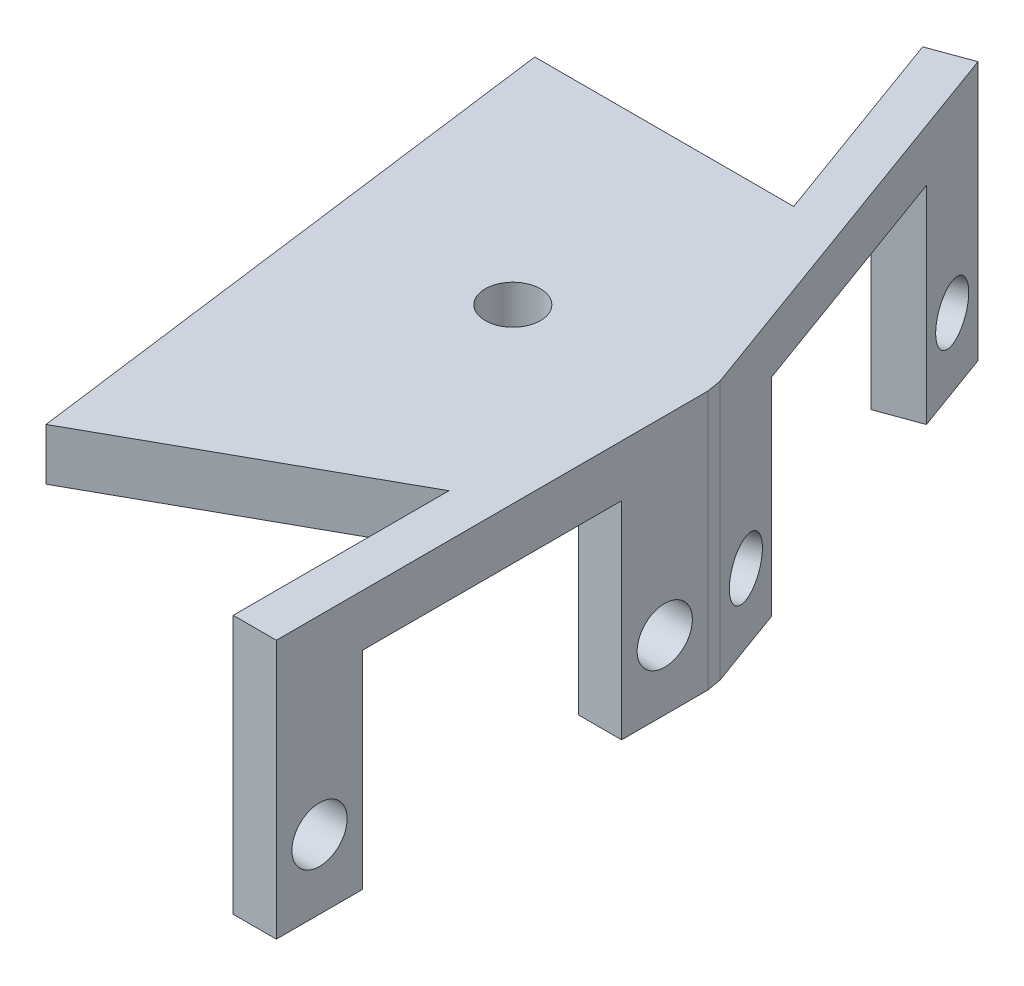
ISO-10303-21;
HEADER;
FILE_DESCRIPTION(('STEP AP214'),'2;1');
FILE_NAME('part.step','',(''),(''),'','','');
FILE_SCHEMA(('AUTOMOTIVE_DESIGN { 1 0 10303 214 1 1 1 1 }'));
ENDSEC;
DATA;
#1=APPLICATION_CONTEXT('core data for automotive mechanical design processes');
#2=APPLICATION_PROTOCOL_DEFINITION('international standard','automotive_design',2000,#1);
#3=PRODUCT_CONTEXT('',#1,'mechanical');
#4=PRODUCT('Part','Part','',(#3));
#5=PRODUCT_RELATED_PRODUCT_CATEGORY('part','',(#4));
#6=PRODUCT_DEFINITION_FORMATION('','',#4);
#7=PRODUCT_DEFINITION_CONTEXT('part definition',#1,'design');
#8=PRODUCT_DEFINITION('design','',#6,#7);
#9=PRODUCT_DEFINITION_SHAPE('','',#8);
#10=(LENGTH_UNIT() NAMED_UNIT(*) SI_UNIT(.MILLI.,.METRE.));
#11=(NAMED_UNIT(*) PLANE_ANGLE_UNIT() SI_UNIT($,.RADIAN.));
#12=(NAMED_UNIT(*) SI_UNIT($,.STERADIAN.) SOLID_ANGLE_UNIT());
#13=UNCERTAINTY_MEASURE_WITH_UNIT(LENGTH_MEASURE(1.E-05),#10,'distance_accuracy_value','');
#14=(GEOMETRIC_REPRESENTATION_CONTEXT(3) GLOBAL_UNCERTAINTY_ASSIGNED_CONTEXT((#13)) GLOBAL_UNIT_ASSIGNED_CONTEXT((#10,
#11,#12)) REPRESENTATION_CONTEXT('',''));
#15=CARTESIAN_POINT('',(0.,0.,0.));
#16=DIRECTION('',(0.,0.,1.));
#17=DIRECTION('',(1.,0.,0.));
#18=AXIS2_PLACEMENT_3D('',#15,#16,#17);
#19=CARTESIAN_POINT('',(-2.96984631039288,-15.,0.));
#20=DIRECTION('',(-1.,0.,0.));
#21=DIRECTION('',(0.,0.,1.));
#22=AXIS2_PLACEMENT_3D('',#19,#20,#21);
#23=PLANE('',#22);
#24=DIRECTION('',(0.,1.,0.));
#25=VECTOR('',#24,1.);
#26=CARTESIAN_POINT('',(-2.96984631039287,-3.,12.6710100716628));
#27=LINE('',#26,#25);
#28=CARTESIAN_POINT('',(-2.96984631039279,-3.,12.6710100716623));
#29=VERTEX_POINT('',#28);
#30=CARTESIAN_POINT('',(-2.96984631039281,0.,12.6710100716628));
#31=VERTEX_POINT('',#30);
#32=EDGE_CURVE('E214',#29,#31,#27,.T.);
#33=ORIENTED_EDGE('',*,*,#32,.F.);
#34=DIRECTION('',(0.,0.,-1.));
#35=VECTOR('',#34,1.);
#36=CARTESIAN_POINT('',(-2.96984631039288,-3.,0.));
#37=LINE('',#36,#35);
#38=CARTESIAN_POINT('',(-2.9698463103928,-3.,20.1710100716628));
#39=VERTEX_POINT('',#38);
#40=EDGE_CURVE('E341',#39,#29,#37,.T.);
#41=ORIENTED_EDGE('',*,*,#40,.F.);
#42=DIRECTION('',(0.,1.,0.));
#43=VECTOR('',#42,1.);
#44=CARTESIAN_POINT('',(-2.96984631039276,-15.,20.1710100716628));
#45=LINE('',#44,#43);
#46=CARTESIAN_POINT('',(-2.96984631039281,-15.,20.1710100716628));
#47=VERTEX_POINT('',#46);
#48=EDGE_CURVE('E273',#47,#39,#45,.T.);
#49=ORIENTED_EDGE('',*,*,#48,.F.);
#50=DIRECTION('',(0.,0.,1.));
#51=VECTOR('',#50,1.);
#52=CARTESIAN_POINT('',(-2.96984631039288,-15.,0.));
#53=LINE('',#52,#51);
#54=CARTESIAN_POINT('',(-2.96984631039274,-15.,25.1710100716628));
#55=VERTEX_POINT('',#54);
#56=EDGE_CURVE('E291',#47,#55,#53,.T.);
#57=ORIENTED_EDGE('',*,*,#56,.T.);
#58=DIRECTION('',(0.,1.,0.));
#59=VECTOR('',#58,1.);
#60=CARTESIAN_POINT('',(-2.96984631039274,-15.,25.1710100716628));
#61=LINE('',#60,#59);
#62=CARTESIAN_POINT('',(-2.96984631039274,0.,25.1710100716628));
#63=VERTEX_POINT('',#62);
#64=EDGE_CURVE('E326',#55,#63,#61,.T.);
#65=ORIENTED_EDGE('',*,*,#64,.T.);
#66=DIRECTION('',(0.,0.,1.));
#67=VECTOR('',#66,1.);
#68=CARTESIAN_POINT('',(-2.96984631039288,0.,0.));
#69=LINE('',#68,#67);
#70=EDGE_CURVE('E66',#31,#63,#69,.T.);
#71=ORIENTED_EDGE('',*,*,#70,.F.);
#72=EDGE_LOOP('',(#33,#41,#49,#57,#65,#71));
#73=FACE_BOUND('',#72,.T.);
#74=CARTESIAN_POINT('',(-2.96984631039275,-11.,22.6710100716628));
#75=DIRECTION('',(-1.,0.,0.));
#76=DIRECTION('',(0.,0.,1.));
#77=AXIS2_PLACEMENT_3D('',#74,#75,#76);
#78=CIRCLE('',#77,1.6);
#79=CARTESIAN_POINT('',(-2.96984631039274,-11.,24.2710100716628));
#80=VERTEX_POINT('',#79);
#81=EDGE_CURVE('E275',#80,#80,#78,.T.);
#82=ORIENTED_EDGE('',*,*,#81,.F.);
#83=EDGE_LOOP('',(#82));
#84=FACE_BOUND('',#83,.T.);
#85=ADVANCED_FACE('F43',(#73,#84),#23,.T.);
#86=CARTESIAN_POINT('',(-2.67740186429161,-15.,0.974494583770972));
#87=DIRECTION('',(0.93969262078591,0.,-0.342020143325665));
#88=DIRECTION('',(-0.342020143325665,0.,-0.93969262078591));
#89=AXIS2_PLACEMENT_3D('',#86,#87,#88);
#90=PLANE('',#89);
#91=CARTESIAN_POINT('',(-10.6652995352203,-11.,-20.9720738960201));
#92=DIRECTION('',(0.93969262078591,0.,-0.342020143325665));
#93=DIRECTION('',(-0.342020143325665,0.,-0.93969262078591));
#94=AXIS2_PLACEMENT_3D('',#91,#92,#93);
#95=CIRCLE('',#94,1.6);
#96=CARTESIAN_POINT('',(-11.2125317645414,-11.,-22.4755820892776));
#97=VERTEX_POINT('',#96);
#98=EDGE_CURVE('E250',#97,#97,#95,.T.);
#99=ORIENTED_EDGE('',*,*,#98,.T.);
#100=EDGE_LOOP('',(#99));
#101=FACE_BOUND('',#100,.T.);
#102=DIRECTION('',(0.342020143325665,0.,0.93969262078591));
#103=VECTOR('',#102,1.);
#104=CARTESIAN_POINT('',(-2.67740186429161,-3.,0.974494583770971));
#105=LINE('',#104,#103);
#106=CARTESIAN_POINT('',(-9.81024917690618,-3.,-18.6228423440554));
#107=VERTEX_POINT('',#106);
#108=CARTESIAN_POINT('',(-7.24509810196369,-3.,-11.5751476881611));
#109=VERTEX_POINT('',#108);
#110=EDGE_CURVE('E245',#107,#109,#105,.T.);
#111=ORIENTED_EDGE('',*,*,#110,.T.);
#112=DIRECTION('',(0.,1.,0.));
#113=VECTOR('',#112,1.);
#114=CARTESIAN_POINT('',(-7.24509810196369,-3.,-11.5751476881611));
#115=LINE('',#114,#113);
#116=CARTESIAN_POINT('',(-7.24509810196369,0.,-11.5751476881611));
#117=VERTEX_POINT('',#116);
#118=EDGE_CURVE('E186',#109,#117,#115,.T.);
#119=ORIENTED_EDGE('',*,*,#118,.T.);
#120=DIRECTION('',(-0.342020143325665,0.,-0.93969262078591));
#121=VECTOR('',#120,1.);
#122=CARTESIAN_POINT('',(-2.67740186429161,0.,0.974494583770972));
#123=LINE('',#122,#121);
#124=CARTESIAN_POINT('',(-11.5203498935345,0.,-23.3213054479849));
#125=VERTEX_POINT('',#124);
#126=EDGE_CURVE('E313',#117,#125,#123,.T.);
#127=ORIENTED_EDGE('',*,*,#126,.T.);
#128=DIRECTION('',(0.,1.,0.));
#129=VECTOR('',#128,1.);
#130=CARTESIAN_POINT('',(-11.5203498935345,-15.,-23.3213054479849));
#131=LINE('',#130,#129);
#132=CARTESIAN_POINT('',(-11.5203498935345,-15.,-23.3213054479849));
#133=VERTEX_POINT('',#132);
#134=EDGE_CURVE('E330',#133,#125,#131,.T.);
#135=ORIENTED_EDGE('',*,*,#134,.F.);
#136=DIRECTION('',(-0.342020143325665,0.,-0.93969262078591));
#137=VECTOR('',#136,1.);
#138=CARTESIAN_POINT('',(-2.67740186429161,-15.,0.974494583770972));
#139=LINE('',#138,#137);
#140=CARTESIAN_POINT('',(-9.81024917690618,-15.,-18.6228423440554));
#141=VERTEX_POINT('',#140);
#142=EDGE_CURVE('E287',#141,#133,#139,.T.);
#143=ORIENTED_EDGE('',*,*,#142,.F.);
#144=DIRECTION('',(0.,1.,0.));
#145=VECTOR('',#144,1.);
#146=CARTESIAN_POINT('',(-9.81024917690618,-15.,-18.6228423440554));
#147=LINE('',#146,#145);
#148=EDGE_CURVE('E238',#141,#107,#147,.T.);
#149=ORIENTED_EDGE('',*,*,#148,.T.);
#150=EDGE_LOOP('',(#111,#119,#127,#135,#143,#149));
#151=FACE_BOUND('',#150,.T.);
#152=ADVANCED_FACE('F355',(#101,#151),#90,.F.);
#153=CARTESIAN_POINT('',(0.,-15.,0.));
#154=DIRECTION('',(0.,1.,0.));
#155=DIRECTION('',(0.,0.,1.));
#156=AXIS2_PLACEMENT_3D('',#153,#154,#155);
#157=PLANE('',#156);
#158=CARTESIAN_POINT('',(-2.96984631039287,-15.,0.171010071662813));
#159=VERTEX_POINT('',#158);
#160=CARTESIAN_POINT('',(-4.6799470270212,-15.,-4.52745303226673));
#161=VERTEX_POINT('',#160);
#162=EDGE_CURVE('E288',#159,#161,#139,.T.);
#163=ORIENTED_EDGE('',*,*,#162,.T.);
#164=DIRECTION('',(0.93969262078591,0.,-0.342020143325665));
#165=VECTOR('',#164,1.);
#166=CARTESIAN_POINT('',(-2.00254516272959,-15.,-5.50194761603771));
#167=LINE('',#166,#165);
#168=CARTESIAN_POINT('',(-2.33071547505643,-15.,-5.3825033905809));
#169=VERTEX_POINT('',#168);
#170=EDGE_CURVE('E11',#161,#169,#167,.T.);
#171=ORIENTED_EDGE('',*,*,#170,.T.);
#172=DIRECTION('',(-0.342020143325665,0.,-0.93969262078591));
#173=VECTOR('',#172,1.);
#174=CARTESIAN_POINT('',(-0.328170312326833,-15.,0.119444225456809));
#175=LINE('',#174,#173);
#176=CARTESIAN_POINT('',(-0.620614758428101,-15.,-0.684040286651349));
#177=VERTEX_POINT('',#176);
#178=EDGE_CURVE('E281',#177,#169,#175,.T.);
#179=ORIENTED_EDGE('',*,*,#178,.F.);
#180=DIRECTION('',(0.173648177667021,0.,0.984807753012192));
#181=VECTOR('',#180,1.);
#182=CARTESIAN_POINT('',(-0.484923155196316,-15.,0.0855050358314348));
#183=LINE('',#182,#181);
#184=CARTESIAN_POINT('',(-0.469846310392793,-15.,0.171010071662807));
#185=VERTEX_POINT('',#184);
#186=EDGE_CURVE('E276',#177,#185,#183,.T.);
#187=ORIENTED_EDGE('',*,*,#186,.T.);
#188=DIRECTION('',(0.,0.,1.));
#189=VECTOR('',#188,1.);
#190=CARTESIAN_POINT('',(-0.469846310392794,-15.,0.));
#191=LINE('',#190,#189);
#192=CARTESIAN_POINT('',(-0.469846310392794,-15.,5.17101007166281));
#193=VERTEX_POINT('',#192);
#194=EDGE_CURVE('E299',#185,#193,#191,.T.);
#195=ORIENTED_EDGE('',*,*,#194,.T.);
#196=DIRECTION('',(-1.,0.,0.));
#197=VECTOR('',#196,1.);
#198=CARTESIAN_POINT('',(0.,-15.,5.17101007166281));
#199=LINE('',#198,#197);
#200=CARTESIAN_POINT('',(-2.96984631039285,-15.,5.17101007166281));
#201=VERTEX_POINT('',#200);
#202=EDGE_CURVE('E322',#193,#201,#199,.T.);
#203=ORIENTED_EDGE('',*,*,#202,.T.);
#204=EDGE_CURVE('E292',#159,#201,#53,.T.);
#205=ORIENTED_EDGE('',*,*,#204,.F.);
#206=EDGE_LOOP('',(#163,#171,#179,#187,#195,#203,#205));
#207=FACE_BOUND('',#206,.T.);
#208=ADVANCED_FACE('F380',(#207),#157,.F.);
#209=ORIENTED_EDGE('',*,*,#56,.F.);
#210=DIRECTION('',(1.,0.,0.));
#211=VECTOR('',#210,1.);
#212=CARTESIAN_POINT('',(0.,-15.,20.1710100716628));
#213=LINE('',#212,#211);
#214=CARTESIAN_POINT('',(-0.469846310392794,-15.,20.1710100716628));
#215=VERTEX_POINT('',#214);
#216=EDGE_CURVE('E338',#47,#215,#213,.T.);
#217=ORIENTED_EDGE('',*,*,#216,.T.);
#218=CARTESIAN_POINT('',(-0.469846310392736,-15.,25.1710100716628));
#219=VERTEX_POINT('',#218);
#220=EDGE_CURVE('E298',#215,#219,#191,.T.);
#221=ORIENTED_EDGE('',*,*,#220,.T.);
#222=DIRECTION('',(-1.,0.,0.));
#223=VECTOR('',#222,1.);
#224=CARTESIAN_POINT('',(2.79454349346317E-13,-15.,25.1710100716628));
#225=LINE('',#224,#223);
#226=EDGE_CURVE('E295',#219,#55,#225,.T.);
#227=ORIENTED_EDGE('',*,*,#226,.T.);
#228=EDGE_LOOP('',(#209,#217,#221,#227));
#229=FACE_BOUND('',#228,.T.);
#230=ADVANCED_FACE('F404',(#229),#157,.F.);
#231=CARTESIAN_POINT('',(-0.484923155196316,-15.,0.0855050358314348));
#232=DIRECTION('',(-0.984807753012192,0.,0.173648177667021));
#233=DIRECTION('',(0.173648177667021,0.,0.984807753012192));
#234=AXIS2_PLACEMENT_3D('',#231,#232,#233);
#235=PLANE('',#234);
#236=DIRECTION('',(0.,1.,0.));
#237=VECTOR('',#236,1.);
#238=CARTESIAN_POINT('',(-0.620614758428101,-15.,-0.684040286651349));
#239=LINE('',#238,#237);
#240=CARTESIAN_POINT('',(-0.620614758428101,0.,-0.684040286651349));
#241=VERTEX_POINT('',#240);
#242=EDGE_CURVE('E302',#177,#241,#239,.T.);
#243=ORIENTED_EDGE('',*,*,#242,.T.);
#244=DIRECTION('',(0.173648177667021,0.,0.984807753012192));
#245=VECTOR('',#244,1.);
#246=CARTESIAN_POINT('',(-0.484923155196316,0.,0.0855050358314348));
#247=LINE('',#246,#245);
#248=CARTESIAN_POINT('',(-0.469846310392793,0.,0.171010071662807));
#249=VERTEX_POINT('',#248);
#250=EDGE_CURVE('E303',#241,#249,#247,.T.);
#251=ORIENTED_EDGE('',*,*,#250,.T.);
#252=DIRECTION('',(0.,1.,0.));
#253=VECTOR('',#252,1.);
#254=CARTESIAN_POINT('',(-0.469846310392793,-15.,0.171010071662807));
#255=LINE('',#254,#253);
#256=EDGE_CURVE('E320',#185,#249,#255,.T.);
#257=ORIENTED_EDGE('',*,*,#256,.F.);
#258=ORIENTED_EDGE('',*,*,#186,.F.);
#259=EDGE_LOOP('',(#243,#251,#257,#258));
#260=FACE_BOUND('',#259,.T.);
#261=ADVANCED_FACE('F45',(#260),#235,.F.);
#262=CARTESIAN_POINT('',(-0.469846310392794,-15.,0.));
#263=DIRECTION('',(-1.,0.,0.));
#264=DIRECTION('',(0.,0.,1.));
#265=AXIS2_PLACEMENT_3D('',#262,#263,#264);
#266=PLANE('',#265);
#267=CARTESIAN_POINT('',(-0.469846310392794,-11.,2.67101007166279));
#268=DIRECTION('',(1.,0.,0.));
#269=DIRECTION('',(0.,0.,-1.));
#270=AXIS2_PLACEMENT_3D('',#267,#268,#269);
#271=CIRCLE('',#270,1.6);
#272=CARTESIAN_POINT('',(-0.469846310392794,-11.,1.07101007166278));
#273=VERTEX_POINT('',#272);
#274=EDGE_CURVE('E253',#273,#273,#271,.T.);
#275=ORIENTED_EDGE('',*,*,#274,.F.);
#276=EDGE_LOOP('',(#275));
#277=FACE_BOUND('',#276,.T.);
#278=CARTESIAN_POINT('',(-0.469846310392794,-11.,22.6710100716628));
#279=DIRECTION('',(1.,0.,0.));
#280=DIRECTION('',(0.,0.,-1.));
#281=AXIS2_PLACEMENT_3D('',#278,#279,#280);
#282=CIRCLE('',#281,1.6);
#283=CARTESIAN_POINT('',(-0.469846310392794,-11.,21.0710100716628));
#284=VERTEX_POINT('',#283);
#285=EDGE_CURVE('E254',#284,#284,#282,.T.);
#286=ORIENTED_EDGE('',*,*,#285,.F.);
#287=EDGE_LOOP('',(#286));
#288=FACE_BOUND('',#287,.T.);
#289=ORIENTED_EDGE('',*,*,#220,.F.);
#290=DIRECTION('',(0.,-1.,0.));
#291=VECTOR('',#290,1.);
#292=CARTESIAN_POINT('',(-0.469846310392794,-15.,20.1710100716628));
#293=LINE('',#292,#291);
#294=CARTESIAN_POINT('',(-0.469846310392794,-3.,20.1710100716628));
#295=VERTEX_POINT('',#294);
#296=EDGE_CURVE('E257',#295,#215,#293,.T.);
#297=ORIENTED_EDGE('',*,*,#296,.F.);
#298=DIRECTION('',(0.,0.,1.));
#299=VECTOR('',#298,1.);
#300=CARTESIAN_POINT('',(-0.469846310392794,-3.,20.1710100716628));
#301=LINE('',#300,#299);
#302=CARTESIAN_POINT('',(-0.469846310392794,-3.,5.17101007166281));
#303=VERTEX_POINT('',#302);
#304=EDGE_CURVE('E264',#303,#295,#301,.T.);
#305=ORIENTED_EDGE('',*,*,#304,.F.);
#306=DIRECTION('',(0.,1.,0.));
#307=VECTOR('',#306,1.);
#308=CARTESIAN_POINT('',(-0.469846310392794,-15.,5.17101007166281));
#309=LINE('',#308,#307);
#310=EDGE_CURVE('E261',#193,#303,#309,.T.);
#311=ORIENTED_EDGE('',*,*,#310,.F.);
#312=ORIENTED_EDGE('',*,*,#194,.F.);
#313=ORIENTED_EDGE('',*,*,#256,.T.);
#314=DIRECTION('',(0.,0.,1.));
#315=VECTOR('',#314,1.);
#316=CARTESIAN_POINT('',(-0.469846310392794,0.,0.));
#317=LINE('',#316,#315);
#318=CARTESIAN_POINT('',(-0.469846310392736,0.,25.1710100716628));
#319=VERTEX_POINT('',#318);
#320=EDGE_CURVE('E280',#249,#319,#317,.T.);
#321=ORIENTED_EDGE('',*,*,#320,.T.);
#322=DIRECTION('',(0.,1.,0.));
#323=VECTOR('',#322,1.);
#324=CARTESIAN_POINT('',(-0.469846310392736,-15.,25.1710100716628));
#325=LINE('',#324,#323);
#326=EDGE_CURVE('E323',#219,#319,#325,.T.);
#327=ORIENTED_EDGE('',*,*,#326,.F.);
#328=EDGE_LOOP('',(#289,#297,#305,#311,#312,#313,#321,#327));
#329=FACE_BOUND('',#328,.T.);
#330=ADVANCED_FACE('F397',(#277,#288,#329),#266,.F.);
#331=CARTESIAN_POINT('',(2.79454349346317E-13,-15.,25.1710100716628));
#332=DIRECTION('',(0.,0.,-1.));
#333=DIRECTION('',(-1.,0.,0.));
#334=AXIS2_PLACEMENT_3D('',#331,#332,#333);
#335=PLANE('',#334);
#336=DIRECTION('',(-1.,0.,0.));
#337=VECTOR('',#336,1.);
#338=CARTESIAN_POINT('',(2.79454349346317E-13,0.,25.1710100716628));
#339=LINE('',#338,#337);
#340=EDGE_CURVE('E316',#319,#63,#339,.T.);
#341=ORIENTED_EDGE('',*,*,#340,.T.);
#342=ORIENTED_EDGE('',*,*,#64,.F.);
#343=ORIENTED_EDGE('',*,*,#226,.F.);
#344=ORIENTED_EDGE('',*,*,#326,.T.);
#345=EDGE_LOOP('',(#341,#342,#343,#344));
#346=FACE_BOUND('',#345,.T.);
#347=ADVANCED_FACE('F413',(#346),#335,.F.);
#348=DIRECTION('',(0.,0.,1.));
#349=VECTOR('',#348,1.);
#350=CARTESIAN_POINT('',(-2.96984631039288,-3.,0.));
#351=LINE('',#350,#349);
#352=CARTESIAN_POINT('',(-2.96984631039287,-3.,0.171010071662813));
#353=VERTEX_POINT('',#352);
#354=CARTESIAN_POINT('',(-2.96984631039285,-3.,5.17101007166281));
#355=VERTEX_POINT('',#354);
#356=EDGE_CURVE('E58',#353,#355,#351,.T.);
#357=ORIENTED_EDGE('',*,*,#356,.F.);
#358=DIRECTION('',(0.,1.,0.));
#359=VECTOR('',#358,1.);
#360=CARTESIAN_POINT('',(-2.96984631039287,-15.,0.171010071662813));
#361=LINE('',#360,#359);
#362=EDGE_CURVE('E328',#159,#353,#361,.T.);
#363=ORIENTED_EDGE('',*,*,#362,.F.);
#364=ORIENTED_EDGE('',*,*,#204,.T.);
#365=DIRECTION('',(0.,-1.,0.));
#366=VECTOR('',#365,1.);
#367=CARTESIAN_POINT('',(-2.96984631039285,-15.,5.17101007166281));
#368=LINE('',#367,#366);
#369=EDGE_CURVE('E270',#355,#201,#368,.T.);
#370=ORIENTED_EDGE('',*,*,#369,.F.);
#371=EDGE_LOOP('',(#357,#363,#364,#370));
#372=FACE_BOUND('',#371,.T.);
#373=CARTESIAN_POINT('',(-2.96984631039286,-11.,2.67101007166279));
#374=DIRECTION('',(-1.,0.,0.));
#375=DIRECTION('',(0.,0.,1.));
#376=AXIS2_PLACEMENT_3D('',#373,#374,#375);
#377=CIRCLE('',#376,1.6);
#378=CARTESIAN_POINT('',(-2.96984631039285,-11.,4.27101007166279));
#379=VERTEX_POINT('',#378);
#380=EDGE_CURVE('E307',#379,#379,#377,.T.);
#381=ORIENTED_EDGE('',*,*,#380,.F.);
#382=EDGE_LOOP('',(#381));
#383=FACE_BOUND('',#382,.T.);
#384=ADVANCED_FACE('F414',(#372,#383),#23,.T.);
#385=CARTESIAN_POINT('',(-3.82489666870704,-11.,-2.17822148030196));
#386=DIRECTION('',(0.93969262078591,0.,-0.342020143325665));
#387=DIRECTION('',(-0.342020143325665,0.,-0.93969262078591));
#388=AXIS2_PLACEMENT_3D('',#385,#386,#387);
#389=CIRCLE('',#388,1.6);
#390=CARTESIAN_POINT('',(-4.3721288980281,-11.,-3.68172967355942));
#391=VERTEX_POINT('',#390);
#392=EDGE_CURVE('E247',#391,#391,#389,.T.);
#393=ORIENTED_EDGE('',*,*,#392,.T.);
#394=EDGE_LOOP('',(#393));
#395=FACE_BOUND('',#394,.T.);
#396=ORIENTED_EDGE('',*,*,#362,.T.);
#397=DIRECTION('',(-0.342020143325665,0.,-0.93969262078591));
#398=VECTOR('',#397,1.);
#399=CARTESIAN_POINT('',(-2.67740186429161,-3.,0.974494583770972));
#400=LINE('',#399,#398);
#401=CARTESIAN_POINT('',(-4.6799470270212,-3.,-4.52745303226673));
#402=VERTEX_POINT('',#401);
#403=EDGE_CURVE('E216',#353,#402,#400,.T.);
#404=ORIENTED_EDGE('',*,*,#403,.T.);
#405=DIRECTION('',(0.,-1.,0.));
#406=VECTOR('',#405,1.);
#407=CARTESIAN_POINT('',(-4.6799470270212,-15.,-4.52745303226673));
#408=LINE('',#407,#406);
#409=EDGE_CURVE('E242',#402,#161,#408,.T.);
#410=ORIENTED_EDGE('',*,*,#409,.T.);
#411=ORIENTED_EDGE('',*,*,#162,.F.);
#412=EDGE_LOOP('',(#396,#404,#410,#411));
#413=FACE_BOUND('',#412,.T.);
#414=ADVANCED_FACE('F387',(#395,#413),#90,.F.);
#415=CARTESIAN_POINT('',(-8.84294802924289,-15.,-24.2958000317559));
#416=DIRECTION('',(0.342020143325665,0.,0.93969262078591));
#417=DIRECTION('',(0.93969262078591,0.,-0.342020143325665));
#418=AXIS2_PLACEMENT_3D('',#415,#416,#417);
#419=PLANE('',#418);
#420=DIRECTION('',(0.93969262078591,0.,-0.342020143325665));
#421=VECTOR('',#420,1.);
#422=CARTESIAN_POINT('',(-8.84294802924289,0.,-24.2958000317559));
#423=LINE('',#422,#421);
#424=CARTESIAN_POINT('',(-9.17111834156973,0.,-24.1763558062991));
#425=VERTEX_POINT('',#424);
#426=EDGE_CURVE('E310',#125,#425,#423,.T.);
#427=ORIENTED_EDGE('',*,*,#426,.T.);
#428=DIRECTION('',(0.,1.,0.));
#429=VECTOR('',#428,1.);
#430=CARTESIAN_POINT('',(-9.17111834156973,-15.,-24.1763558062991));
#431=LINE('',#430,#429);
#432=CARTESIAN_POINT('',(-9.17111834156973,-15.,-24.1763558062991));
#433=VERTEX_POINT('',#432);
#434=EDGE_CURVE('E333',#433,#425,#431,.T.);
#435=ORIENTED_EDGE('',*,*,#434,.F.);
#436=DIRECTION('',(0.93969262078591,0.,-0.342020143325665));
#437=VECTOR('',#436,1.);
#438=CARTESIAN_POINT('',(-8.84294802924289,-15.,-24.2958000317559));
#439=LINE('',#438,#437);
#440=EDGE_CURVE('E284',#133,#433,#439,.T.);
#441=ORIENTED_EDGE('',*,*,#440,.F.);
#442=ORIENTED_EDGE('',*,*,#134,.T.);
#443=EDGE_LOOP('',(#427,#435,#441,#442));
#444=FACE_BOUND('',#443,.T.);
#445=ADVANCED_FACE('F360',(#444),#419,.F.);
#446=CARTESIAN_POINT('',(-0.328170312326833,-15.,0.119444225456809));
#447=DIRECTION('',(0.93969262078591,0.,-0.342020143325665));
#448=DIRECTION('',(-0.342020143325665,0.,-0.93969262078591));
#449=AXIS2_PLACEMENT_3D('',#446,#447,#448);
#450=PLANE('',#449);
#451=CARTESIAN_POINT('',(-8.31606798325557,-11.,-21.8271242543343));
#452=DIRECTION('',(0.93969262078591,0.,-0.342020143325665));
#453=DIRECTION('',(-0.342020143325665,0.,-0.93969262078591));
#454=AXIS2_PLACEMENT_3D('',#451,#452,#453);
#455=CIRCLE('',#454,1.6);
#456=CARTESIAN_POINT('',(-8.86330021257663,-11.,-23.3306324475918));
#457=VERTEX_POINT('',#456);
#458=EDGE_CURVE('E221',#457,#457,#455,.T.);
#459=ORIENTED_EDGE('',*,*,#458,.F.);
#460=EDGE_LOOP('',(#459));
#461=FACE_BOUND('',#460,.T.);
#462=CARTESIAN_POINT('',(-1.47566511674226,-11.,-3.03327183861612));
#463=DIRECTION('',(0.93969262078591,0.,-0.342020143325665));
#464=DIRECTION('',(-0.342020143325665,0.,-0.93969262078591));
#465=AXIS2_PLACEMENT_3D('',#462,#463,#464);
#466=CIRCLE('',#465,1.6);
#467=CARTESIAN_POINT('',(-2.02289734606333,-11.,-4.53678003187358));
#468=VERTEX_POINT('',#467);
#469=EDGE_CURVE('E222',#468,#468,#466,.T.);
#470=ORIENTED_EDGE('',*,*,#469,.F.);
#471=EDGE_LOOP('',(#470));
#472=FACE_BOUND('',#471,.T.);
#473=DIRECTION('',(0.,-1.,0.));
#474=VECTOR('',#473,1.);
#475=CARTESIAN_POINT('',(-2.33071547505643,-15.1192251931733,-5.3825033905809));
#476=LINE('',#475,#474);
#477=CARTESIAN_POINT('',(-2.33071547505643,-3.,-5.3825033905809));
#478=VERTEX_POINT('',#477);
#479=EDGE_CURVE('E225',#478,#169,#476,.T.);
#480=ORIENTED_EDGE('',*,*,#479,.F.);
#481=DIRECTION('',(0.342020143325665,0.,0.93969262078591));
#482=VECTOR('',#481,1.);
#483=CARTESIAN_POINT('',(-2.33071547505643,-3.,-5.3825033905809));
#484=LINE('',#483,#482);
#485=CARTESIAN_POINT('',(-7.46101762494141,-3.,-19.4778927023695));
#486=VERTEX_POINT('',#485);
#487=EDGE_CURVE('E232',#486,#478,#484,.T.);
#488=ORIENTED_EDGE('',*,*,#487,.F.);
#489=DIRECTION('',(0.,1.,0.));
#490=VECTOR('',#489,1.);
#491=CARTESIAN_POINT('',(-7.46101762494141,-15.1192251931733,-19.4778927023695));
#492=LINE('',#491,#490);
#493=CARTESIAN_POINT('',(-7.46101762494141,-15.,-19.4778927023695));
#494=VERTEX_POINT('',#493);
#495=EDGE_CURVE('E229',#494,#486,#492,.T.);
#496=ORIENTED_EDGE('',*,*,#495,.F.);
#497=EDGE_CURVE('E279',#494,#433,#175,.T.);
#498=ORIENTED_EDGE('',*,*,#497,.T.);
#499=ORIENTED_EDGE('',*,*,#434,.T.);
#500=DIRECTION('',(-0.342020143325665,0.,-0.93969262078591));
#501=VECTOR('',#500,1.);
#502=CARTESIAN_POINT('',(-0.328170312326833,0.,0.119444225456809));
#503=LINE('',#502,#501);
#504=EDGE_CURVE('E306',#241,#425,#503,.T.);
#505=ORIENTED_EDGE('',*,*,#504,.F.);
#506=ORIENTED_EDGE('',*,*,#242,.F.);
#507=ORIENTED_EDGE('',*,*,#178,.T.);
#508=EDGE_LOOP('',(#480,#488,#496,#498,#499,#505,#506,#507));
#509=FACE_BOUND('',#508,.T.);
#510=ADVANCED_FACE('F364',(#461,#472,#509),#450,.T.);
#511=ORIENTED_EDGE('',*,*,#497,.F.);
#512=DIRECTION('',(-0.93969262078591,0.,0.342020143325665));
#513=VECTOR('',#512,1.);
#514=CARTESIAN_POINT('',(-7.13284731261457,-15.,-19.5973369278263));
#515=LINE('',#514,#513);
#516=EDGE_CURVE('E51',#494,#141,#515,.T.);
#517=ORIENTED_EDGE('',*,*,#516,.T.);
#518=ORIENTED_EDGE('',*,*,#142,.T.);
#519=ORIENTED_EDGE('',*,*,#440,.T.);
#520=EDGE_LOOP('',(#511,#517,#518,#519));
#521=FACE_BOUND('',#520,.T.);
#522=ADVANCED_FACE('F350',(#521),#157,.F.);
#523=CARTESIAN_POINT('',(0.,0.,0.));
#524=DIRECTION('',(0.,1.,0.));
#525=DIRECTION('',(0.,0.,1.));
#526=AXIS2_PLACEMENT_3D('',#523,#524,#525);
#527=PLANE('',#526);
#528=DIRECTION('',(0.873855820915996,0.,-0.486185154289217));
#529=VECTOR('',#528,1.);
#530=CARTESIAN_POINT('',(-17.9698463103929,0.,21.0165255901082));
#531=LINE('',#530,#529);
#532=CARTESIAN_POINT('',(-17.9698463103929,0.,21.0165255901082));
#533=VERTEX_POINT('',#532);
#534=EDGE_CURVE('E201',#533,#31,#531,.T.);
#535=ORIENTED_EDGE('',*,*,#534,.T.);
#536=ORIENTED_EDGE('',*,*,#70,.T.);
#537=ORIENTED_EDGE('',*,*,#340,.F.);
#538=ORIENTED_EDGE('',*,*,#320,.F.);
#539=ORIENTED_EDGE('',*,*,#250,.F.);
#540=ORIENTED_EDGE('',*,*,#504,.T.);
#541=ORIENTED_EDGE('',*,*,#426,.F.);
#542=ORIENTED_EDGE('',*,*,#126,.F.);
#543=DIRECTION('',(-1.,0.,0.));
#544=VECTOR('',#543,1.);
#545=CARTESIAN_POINT('',(-7.24509810196369,0.,-11.5751476881611));
#546=LINE('',#545,#544);
#547=CARTESIAN_POINT('',(-22.2450981019637,0.,-11.5751476881611));
#548=VERTEX_POINT('',#547);
#549=EDGE_CURVE('E210',#117,#548,#546,.T.);
#550=ORIENTED_EDGE('',*,*,#549,.T.);
#551=DIRECTION('',(0.130061970040809,0.,0.991505866825358));
#552=VECTOR('',#551,1.);
#553=CARTESIAN_POINT('',(-22.2450981019637,0.,-11.5751476881611));
#554=LINE('',#553,#552);
#555=EDGE_CURVE('E180',#548,#533,#554,.T.);
#556=ORIENTED_EDGE('',*,*,#555,.T.);
#557=EDGE_LOOP('',(#535,#536,#537,#538,#539,#540,#541,#542,#550,#556));
#558=FACE_BOUND('',#557,.T.);
#559=CARTESIAN_POINT('',(-10.4523362419761,0.,1.49037492948131));
#560=DIRECTION('',(0.,1.,0.));
#561=DIRECTION('',(0.,0.,1.));
#562=AXIS2_PLACEMENT_3D('',#559,#560,#561);
#563=CIRCLE('',#562,1.6);
#564=CARTESIAN_POINT('',(-10.4523362419761,0.,3.09037492948131));
#565=VERTEX_POINT('',#564);
#566=EDGE_CURVE('E206',#565,#565,#563,.T.);
#567=ORIENTED_EDGE('',*,*,#566,.F.);
#568=EDGE_LOOP('',(#567));
#569=FACE_BOUND('',#568,.T.);
#570=ADVANCED_FACE('F370',(#558,#569),#527,.T.);
#571=CARTESIAN_POINT('',(-15.4698463103928,-15.,20.1710100716628));
#572=DIRECTION('',(0.,0.,1.));
#573=DIRECTION('',(1.,0.,0.));
#574=AXIS2_PLACEMENT_3D('',#571,#572,#573);
#575=PLANE('',#574);
#576=ORIENTED_EDGE('',*,*,#48,.T.);
#577=DIRECTION('',(1.,0.,0.));
#578=VECTOR('',#577,1.);
#579=CARTESIAN_POINT('',(-15.4698463103928,-3.,20.1710100716628));
#580=LINE('',#579,#578);
#581=EDGE_CURVE('E268',#39,#295,#580,.T.);
#582=ORIENTED_EDGE('',*,*,#581,.T.);
#583=ORIENTED_EDGE('',*,*,#296,.T.);
#584=ORIENTED_EDGE('',*,*,#216,.F.);
#585=EDGE_LOOP('',(#576,#582,#583,#584));
#586=FACE_BOUND('',#585,.T.);
#587=ADVANCED_FACE('F400',(#586),#575,.F.);
#588=CARTESIAN_POINT('',(-15.4698463103928,-3.,20.1710100716628));
#589=DIRECTION('',(0.,1.,0.));
#590=DIRECTION('',(0.,0.,1.));
#591=AXIS2_PLACEMENT_3D('',#588,#589,#590);
#592=PLANE('',#591);
#593=ORIENTED_EDGE('',*,*,#40,.T.);
#594=DIRECTION('',(0.873855820915996,0.,-0.486185154289217));
#595=VECTOR('',#594,1.);
#596=CARTESIAN_POINT('',(-17.9698463103929,-3.,21.0165255901082));
#597=LINE('',#596,#595);
#598=CARTESIAN_POINT('',(-17.9698463103929,-3.,21.0165255901082));
#599=VERTEX_POINT('',#598);
#600=EDGE_CURVE('E196',#599,#29,#597,.T.);
#601=ORIENTED_EDGE('',*,*,#600,.F.);
#602=DIRECTION('',(0.130061970040809,0.,0.991505866825358));
#603=VECTOR('',#602,1.);
#604=CARTESIAN_POINT('',(-22.2450981019637,-3.,-11.5751476881611));
#605=LINE('',#604,#603);
#606=CARTESIAN_POINT('',(-22.2450981019637,-3.,-11.5751476881611));
#607=VERTEX_POINT('',#606);
#608=EDGE_CURVE('E178',#607,#599,#605,.T.);
#609=ORIENTED_EDGE('',*,*,#608,.F.);
#610=DIRECTION('',(-1.,0.,0.));
#611=VECTOR('',#610,1.);
#612=CARTESIAN_POINT('',(-7.24509810196369,-3.,-11.5751476881611));
#613=LINE('',#612,#611);
#614=EDGE_CURVE('E194',#109,#607,#613,.T.);
#615=ORIENTED_EDGE('',*,*,#614,.F.);
#616=ORIENTED_EDGE('',*,*,#110,.F.);
#617=DIRECTION('',(0.93969262078591,0.,-0.342020143325665));
#618=VECTOR('',#617,1.);
#619=CARTESIAN_POINT('',(-21.55640693673,-3.,-14.3475905524846));
#620=LINE('',#619,#618);
#621=EDGE_CURVE('E235',#107,#486,#620,.T.);
#622=ORIENTED_EDGE('',*,*,#621,.T.);
#623=ORIENTED_EDGE('',*,*,#487,.T.);
#624=DIRECTION('',(0.93969262078591,0.,-0.342020143325665));
#625=VECTOR('',#624,1.);
#626=CARTESIAN_POINT('',(-16.4261047868451,-3.,-0.252201240695916));
#627=LINE('',#626,#625);
#628=EDGE_CURVE('E236',#402,#478,#627,.T.);
#629=ORIENTED_EDGE('',*,*,#628,.F.);
#630=ORIENTED_EDGE('',*,*,#403,.F.);
#631=ORIENTED_EDGE('',*,*,#356,.T.);
#632=DIRECTION('',(1.,0.,0.));
#633=VECTOR('',#632,1.);
#634=CARTESIAN_POINT('',(-15.4698463103928,-3.,5.17101007166281));
#635=LINE('',#634,#633);
#636=EDGE_CURVE('E267',#355,#303,#635,.T.);
#637=ORIENTED_EDGE('',*,*,#636,.T.);
#638=ORIENTED_EDGE('',*,*,#304,.T.);
#639=ORIENTED_EDGE('',*,*,#581,.F.);
#640=EDGE_LOOP('',(#593,#601,#609,#615,#616,#622,#623,#629,#630,#631,#637,#638,#639));
#641=FACE_BOUND('',#640,.T.);
#642=CARTESIAN_POINT('',(-10.4523362419761,-3.,1.49037492948131));
#643=DIRECTION('',(0.,1.,0.));
#644=DIRECTION('',(0.,0.,1.));
#645=AXIS2_PLACEMENT_3D('',#642,#643,#644);
#646=CIRCLE('',#645,1.6);
#647=CARTESIAN_POINT('',(-10.4523362419761,-3.,3.09037492948131));
#648=VERTEX_POINT('',#647);
#649=EDGE_CURVE('E212',#648,#648,#646,.T.);
#650=ORIENTED_EDGE('',*,*,#649,.T.);
#651=EDGE_LOOP('',(#650));
#652=FACE_BOUND('',#651,.T.);
#653=ADVANCED_FACE('F192',(#641,#652),#592,.F.);
#654=CARTESIAN_POINT('',(-15.4698463103928,-15.,5.17101007166281));
#655=DIRECTION('',(0.,0.,-1.));
#656=DIRECTION('',(-1.,0.,0.));
#657=AXIS2_PLACEMENT_3D('',#654,#655,#656);
#658=PLANE('',#657);
#659=ORIENTED_EDGE('',*,*,#369,.T.);
#660=ORIENTED_EDGE('',*,*,#202,.F.);
#661=ORIENTED_EDGE('',*,*,#310,.T.);
#662=ORIENTED_EDGE('',*,*,#636,.F.);
#663=EDGE_LOOP('',(#659,#660,#661,#662));
#664=FACE_BOUND('',#663,.T.);
#665=ADVANCED_FACE('F394',(#664),#658,.F.);
#666=CARTESIAN_POINT('',(-15.4698463103928,-11.,22.6710100716628));
#667=DIRECTION('',(1.,0.,0.));
#668=DIRECTION('',(0.,0.,-1.));
#669=AXIS2_PLACEMENT_3D('',#666,#667,#668);
#670=CYLINDRICAL_SURFACE('',#669,1.6);
#671=ORIENTED_EDGE('',*,*,#81,.T.);
#672=EDGE_LOOP('',(#671));
#673=FACE_BOUND('',#672,.T.);
#674=ORIENTED_EDGE('',*,*,#285,.T.);
#675=EDGE_LOOP('',(#674));
#676=FACE_BOUND('',#675,.T.);
#677=ADVANCED_FACE('F423',(#673,#676),#670,.F.);
#678=CARTESIAN_POINT('',(-15.4698463103928,-11.,2.67101007166279));
#679=DIRECTION('',(1.,0.,0.));
#680=DIRECTION('',(0.,0.,-1.));
#681=AXIS2_PLACEMENT_3D('',#678,#679,#680);
#682=CYLINDRICAL_SURFACE('',#681,1.6);
#683=ORIENTED_EDGE('',*,*,#380,.T.);
#684=EDGE_LOOP('',(#683));
#685=FACE_BOUND('',#684,.T.);
#686=ORIENTED_EDGE('',*,*,#274,.T.);
#687=EDGE_LOOP('',(#686));
#688=FACE_BOUND('',#687,.T.);
#689=ADVANCED_FACE('F420',(#685,#688),#682,.F.);
#690=CARTESIAN_POINT('',(-16.4261047868451,-15.1192251931733,-0.252201240695916));
#691=DIRECTION('',(0.342020143325665,0.,0.93969262078591));
#692=DIRECTION('',(0.93969262078591,0.,-0.342020143325665));
#693=AXIS2_PLACEMENT_3D('',#690,#691,#692);
#694=PLANE('',#693);
#695=ORIENTED_EDGE('',*,*,#628,.T.);
#696=ORIENTED_EDGE('',*,*,#479,.T.);
#697=ORIENTED_EDGE('',*,*,#170,.F.);
#698=ORIENTED_EDGE('',*,*,#409,.F.);
#699=EDGE_LOOP('',(#695,#696,#697,#698));
#700=FACE_BOUND('',#699,.T.);
#701=ADVANCED_FACE('F385',(#700),#694,.F.);
#702=CARTESIAN_POINT('',(-21.55640693673,-15.1192251931733,-14.3475905524846));
#703=DIRECTION('',(-0.342020143325665,0.,-0.93969262078591));
#704=DIRECTION('',(-0.93969262078591,0.,0.342020143325665));
#705=AXIS2_PLACEMENT_3D('',#702,#703,#704);
#706=PLANE('',#705);
#707=ORIENTED_EDGE('',*,*,#516,.F.);
#708=ORIENTED_EDGE('',*,*,#495,.T.);
#709=ORIENTED_EDGE('',*,*,#621,.F.);
#710=ORIENTED_EDGE('',*,*,#148,.F.);
#711=EDGE_LOOP('',(#707,#708,#709,#710));
#712=FACE_BOUND('',#711,.T.);
#713=ADVANCED_FACE('F367',(#712),#706,.F.);
#714=CARTESIAN_POINT('',(-15.5710544285309,-11.,2.09703031126886));
#715=DIRECTION('',(0.93969262078591,0.,-0.342020143325665));
#716=DIRECTION('',(-0.342020143325665,0.,-0.93969262078591));
#717=AXIS2_PLACEMENT_3D('',#714,#715,#716);
#718=CYLINDRICAL_SURFACE('',#717,1.6);
#719=ORIENTED_EDGE('',*,*,#469,.T.);
#720=EDGE_LOOP('',(#719));
#721=FACE_BOUND('',#720,.T.);
#722=ORIENTED_EDGE('',*,*,#392,.F.);
#723=EDGE_LOOP('',(#722));
#724=FACE_BOUND('',#723,.T.);
#725=ADVANCED_FACE('F461',(#721,#724),#718,.F.);
#726=CARTESIAN_POINT('',(-22.4114572950442,-11.,-16.6968221044493));
#727=DIRECTION('',(0.93969262078591,0.,-0.342020143325665));
#728=DIRECTION('',(-0.342020143325665,0.,-0.93969262078591));
#729=AXIS2_PLACEMENT_3D('',#726,#727,#728);
#730=CYLINDRICAL_SURFACE('',#729,1.6);
#731=ORIENTED_EDGE('',*,*,#458,.T.);
#732=EDGE_LOOP('',(#731));
#733=FACE_BOUND('',#732,.T.);
#734=ORIENTED_EDGE('',*,*,#98,.F.);
#735=EDGE_LOOP('',(#734));
#736=FACE_BOUND('',#735,.T.);
#737=ADVANCED_FACE('F464',(#733,#736),#730,.F.);
#738=CARTESIAN_POINT('',(-17.9698463103929,-3.,21.0165255901082));
#739=DIRECTION('',(0.486185154289217,0.,0.873855820915997));
#740=DIRECTION('',(0.873855820915997,0.,-0.486185154289217));
#741=AXIS2_PLACEMENT_3D('',#738,#739,#740);
#742=PLANE('',#741);
#743=ORIENTED_EDGE('',*,*,#534,.F.);
#744=DIRECTION('',(0.,1.,0.));
#745=VECTOR('',#744,1.);
#746=CARTESIAN_POINT('',(-17.9698463103929,-3.,21.0165255901082));
#747=LINE('',#746,#745);
#748=EDGE_CURVE('E185',#599,#533,#747,.T.);
#749=ORIENTED_EDGE('',*,*,#748,.F.);
#750=ORIENTED_EDGE('',*,*,#600,.T.);
#751=ORIENTED_EDGE('',*,*,#32,.T.);
#752=EDGE_LOOP('',(#743,#749,#750,#751));
#753=FACE_BOUND('',#752,.T.);
#754=ADVANCED_FACE('F411',(#753),#742,.T.);
#755=CARTESIAN_POINT('',(-22.2450981019637,-3.,-11.5751476881611));
#756=DIRECTION('',(-0.991505866825358,0.,0.130061970040809));
#757=DIRECTION('',(0.130061970040809,0.,0.991505866825358));
#758=AXIS2_PLACEMENT_3D('',#755,#756,#757);
#759=PLANE('',#758);
#760=ORIENTED_EDGE('',*,*,#555,.F.);
#761=DIRECTION('',(0.,1.,0.));
#762=VECTOR('',#761,1.);
#763=CARTESIAN_POINT('',(-22.2450981019637,-3.,-11.5751476881611));
#764=LINE('',#763,#762);
#765=EDGE_CURVE('E175',#607,#548,#764,.T.);
#766=ORIENTED_EDGE('',*,*,#765,.F.);
#767=ORIENTED_EDGE('',*,*,#608,.T.);
#768=ORIENTED_EDGE('',*,*,#748,.T.);
#769=EDGE_LOOP('',(#760,#766,#767,#768));
#770=FACE_BOUND('',#769,.T.);
#771=ADVANCED_FACE('F177',(#770),#759,.T.);
#772=CARTESIAN_POINT('',(-7.24509810196369,-3.,-11.5751476881611));
#773=DIRECTION('',(0.,0.,-1.));
#774=DIRECTION('',(-1.,0.,0.));
#775=AXIS2_PLACEMENT_3D('',#772,#773,#774);
#776=PLANE('',#775);
#777=ORIENTED_EDGE('',*,*,#549,.F.);
#778=ORIENTED_EDGE('',*,*,#118,.F.);
#779=ORIENTED_EDGE('',*,*,#614,.T.);
#780=ORIENTED_EDGE('',*,*,#765,.T.);
#781=EDGE_LOOP('',(#777,#778,#779,#780));
#782=FACE_BOUND('',#781,.T.);
#783=ADVANCED_FACE('F199',(#782),#776,.T.);
#784=CARTESIAN_POINT('',(-10.4523362419761,-3.,1.49037492948131));
#785=DIRECTION('',(0.,1.,0.));
#786=DIRECTION('',(0.,0.,1.));
#787=AXIS2_PLACEMENT_3D('',#784,#785,#786);
#788=CYLINDRICAL_SURFACE('',#787,1.6);
#789=ORIENTED_EDGE('',*,*,#649,.F.);
#790=EDGE_LOOP('',(#789));
#791=FACE_BOUND('',#790,.T.);
#792=ORIENTED_EDGE('',*,*,#566,.T.);
#793=EDGE_LOOP('',(#792));
#794=FACE_BOUND('',#793,.T.);
#795=ADVANCED_FACE('F699',(#791,#794),#788,.F.);
#796=CLOSED_SHELL('',(#85,#152,#208,#230,#261,#330,#347,#384,#414,#445,#510,#522,#570,#587,#653,
#665,#677,#689,#701,#713,#725,#737,#754,#771,#783,#795));
#797=MANIFOLD_SOLID_BREP('B2',#796);
#798=ADVANCED_BREP_SHAPE_REPRESENTATION('',(#18,#797),#14);
#799=SHAPE_DEFINITION_REPRESENTATION(#9,#798);
ENDSEC;
END-ISO-10303-21;
